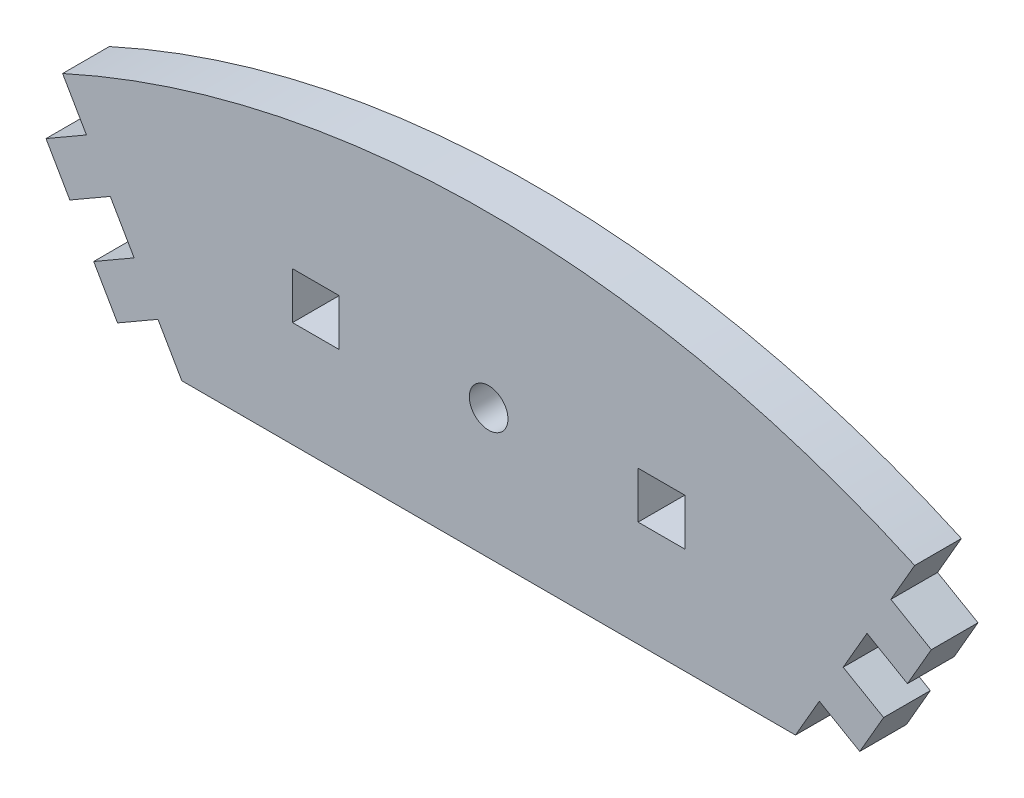
ISO-10303-21;
HEADER;
FILE_DESCRIPTION(('STEP AP214'),'2;1');
FILE_NAME('part.step','',(''),(''),'','','');
FILE_SCHEMA(('AUTOMOTIVE_DESIGN { 1 0 10303 214 1 1 1 1 }'));
ENDSEC;
DATA;
#1=APPLICATION_CONTEXT('core data for automotive mechanical design processes');
#2=APPLICATION_PROTOCOL_DEFINITION('international standard','automotive_design',2000,#1);
#3=PRODUCT_CONTEXT('',#1,'mechanical');
#4=PRODUCT('Part','Part','',(#3));
#5=PRODUCT_RELATED_PRODUCT_CATEGORY('part','',(#4));
#6=PRODUCT_DEFINITION_FORMATION('','',#4);
#7=PRODUCT_DEFINITION_CONTEXT('part definition',#1,'design');
#8=PRODUCT_DEFINITION('design','',#6,#7);
#9=PRODUCT_DEFINITION_SHAPE('','',#8);
#10=(LENGTH_UNIT() NAMED_UNIT(*) SI_UNIT(.MILLI.,.METRE.));
#11=(NAMED_UNIT(*) PLANE_ANGLE_UNIT() SI_UNIT($,.RADIAN.));
#12=(NAMED_UNIT(*) SI_UNIT($,.STERADIAN.) SOLID_ANGLE_UNIT());
#13=UNCERTAINTY_MEASURE_WITH_UNIT(LENGTH_MEASURE(1.E-05),#10,'distance_accuracy_value','');
#14=(GEOMETRIC_REPRESENTATION_CONTEXT(3) GLOBAL_UNCERTAINTY_ASSIGNED_CONTEXT((#13)) GLOBAL_UNIT_ASSIGNED_CONTEXT((#10,
#11,#12)) REPRESENTATION_CONTEXT('',''));
#15=CARTESIAN_POINT('',(0.,0.,0.));
#16=DIRECTION('',(0.,0.,1.));
#17=DIRECTION('',(1.,0.,0.));
#18=AXIS2_PLACEMENT_3D('',#15,#16,#17);
#19=CARTESIAN_POINT('',(-35.403,82.4086096476236,5.));
#20=DIRECTION('',(-0.500000000000001,0.866025403784438,0.));
#21=DIRECTION('',(-0.866025403784438,-0.500000000000001,0.));
#22=AXIS2_PLACEMENT_3D('',#19,#20,#21);
#23=PLANE('',#22);
#24=DIRECTION('',(0.866025403784438,0.500000000000001,0.));
#25=VECTOR('',#24,1.);
#26=CARTESIAN_POINT('',(-35.403,82.4086096476236,0.));
#27=LINE('',#26,#25);
#28=CARTESIAN_POINT('',(-39.7331270189221,79.9086096476237,0.));
#29=VERTEX_POINT('',#28);
#30=CARTESIAN_POINT('',(-35.403,82.4086096476236,0.));
#31=VERTEX_POINT('',#30);
#32=EDGE_CURVE('E283',#29,#31,#27,.T.);
#33=ORIENTED_EDGE('',*,*,#32,.T.);
#34=DIRECTION('',(0.,0.,-1.));
#35=VECTOR('',#34,1.);
#36=CARTESIAN_POINT('',(-35.403,82.4086096476236,5.));
#37=LINE('',#36,#35);
#38=CARTESIAN_POINT('',(-35.403,82.4086096476236,5.));
#39=VERTEX_POINT('',#38);
#40=EDGE_CURVE('E11',#39,#31,#37,.T.);
#41=ORIENTED_EDGE('',*,*,#40,.F.);
#42=DIRECTION('',(0.866025403784438,0.500000000000001,0.));
#43=VECTOR('',#42,1.);
#44=CARTESIAN_POINT('',(-35.403,82.4086096476236,5.));
#45=LINE('',#44,#43);
#46=CARTESIAN_POINT('',(-39.7331270189221,79.9086096476237,5.));
#47=VERTEX_POINT('',#46);
#48=EDGE_CURVE('E290',#47,#39,#45,.T.);
#49=ORIENTED_EDGE('',*,*,#48,.F.);
#50=DIRECTION('',(0.,0.,-1.));
#51=VECTOR('',#50,1.);
#52=CARTESIAN_POINT('',(-39.7331270189221,79.9086096476237,5.));
#53=LINE('',#52,#51);
#54=EDGE_CURVE('E332',#47,#29,#53,.T.);
#55=ORIENTED_EDGE('',*,*,#54,.T.);
#56=EDGE_LOOP('',(#33,#41,#49,#55));
#57=FACE_BOUND('',#56,.T.);
#58=ADVANCED_FACE('F33',(#57),#23,.F.);
#59=CARTESIAN_POINT('',(-32.85,77.9866839359003,5.));
#60=DIRECTION('',(0.866025403784441,0.499999999999996,0.));
#61=DIRECTION('',(-0.499999999999996,0.866025403784441,0.));
#62=AXIS2_PLACEMENT_3D('',#59,#60,#61);
#63=PLANE('',#62);
#64=DIRECTION('',(0.499999999999996,-0.866025403784441,0.));
#65=VECTOR('',#64,1.);
#66=CARTESIAN_POINT('',(-32.85,77.9866839359003,0.));
#67=LINE('',#66,#65);
#68=CARTESIAN_POINT('',(-32.85,77.9866839359003,0.));
#69=VERTEX_POINT('',#68);
#70=EDGE_CURVE('E335',#31,#69,#67,.T.);
#71=ORIENTED_EDGE('',*,*,#70,.T.);
#72=DIRECTION('',(0.,0.,-1.));
#73=VECTOR('',#72,1.);
#74=CARTESIAN_POINT('',(-32.85,77.9866839359003,5.));
#75=LINE('',#74,#73);
#76=CARTESIAN_POINT('',(-32.85,77.9866839359003,5.));
#77=VERTEX_POINT('',#76);
#78=EDGE_CURVE('E40',#77,#69,#75,.T.);
#79=ORIENTED_EDGE('',*,*,#78,.F.);
#80=DIRECTION('',(0.499999999999996,-0.866025403784441,0.));
#81=VECTOR('',#80,1.);
#82=CARTESIAN_POINT('',(-32.85,77.9866839359003,5.));
#83=LINE('',#82,#81);
#84=EDGE_CURVE('E293',#39,#77,#83,.T.);
#85=ORIENTED_EDGE('',*,*,#84,.F.);
#86=ORIENTED_EDGE('',*,*,#40,.T.);
#87=EDGE_LOOP('',(#71,#79,#85,#86));
#88=FACE_BOUND('',#87,.T.);
#89=ADVANCED_FACE('F451',(#88),#63,.F.);
#90=CARTESIAN_POINT('',(-32.85,77.9866839359003,5.));
#91=DIRECTION('',(0.,1.,0.));
#92=DIRECTION('',(-1.,0.,0.));
#93=AXIS2_PLACEMENT_3D('',#90,#91,#92);
#94=PLANE('',#93);
#95=DIRECTION('',(1.,0.,0.));
#96=VECTOR('',#95,1.);
#97=CARTESIAN_POINT('',(-32.85,77.9866839359003,0.));
#98=LINE('',#97,#96);
#99=CARTESIAN_POINT('',(32.85,77.9866839359003,0.));
#100=VERTEX_POINT('',#99);
#101=EDGE_CURVE('E337',#69,#100,#98,.T.);
#102=ORIENTED_EDGE('',*,*,#101,.T.);
#103=DIRECTION('',(0.,0.,-1.));
#104=VECTOR('',#103,1.);
#105=CARTESIAN_POINT('',(32.85,77.9866839359003,5.));
#106=LINE('',#105,#104);
#107=CARTESIAN_POINT('',(32.85,77.9866839359003,5.));
#108=VERTEX_POINT('',#107);
#109=EDGE_CURVE('E422',#108,#100,#106,.T.);
#110=ORIENTED_EDGE('',*,*,#109,.F.);
#111=DIRECTION('',(1.,0.,0.));
#112=VECTOR('',#111,1.);
#113=CARTESIAN_POINT('',(-32.85,77.9866839359003,5.));
#114=LINE('',#113,#112);
#115=EDGE_CURVE('E296',#77,#108,#114,.T.);
#116=ORIENTED_EDGE('',*,*,#115,.F.);
#117=ORIENTED_EDGE('',*,*,#78,.T.);
#118=EDGE_LOOP('',(#102,#110,#116,#117));
#119=FACE_BOUND('',#118,.T.);
#120=ADVANCED_FACE('F429',(#119),#94,.F.);
#121=CARTESIAN_POINT('',(32.85,77.9866839359003,5.));
#122=DIRECTION('',(-0.86602540378444,0.499999999999997,0.));
#123=DIRECTION('',(-0.499999999999997,-0.86602540378444,0.));
#124=AXIS2_PLACEMENT_3D('',#121,#122,#123);
#125=PLANE('',#124);
#126=DIRECTION('',(0.499999999999997,0.86602540378444,0.));
#127=VECTOR('',#126,1.);
#128=CARTESIAN_POINT('',(32.85,77.9866839359003,0.));
#129=LINE('',#128,#127);
#130=CARTESIAN_POINT('',(35.403,82.4086096476236,0.));
#131=VERTEX_POINT('',#130);
#132=EDGE_CURVE('E339',#100,#131,#129,.T.);
#133=ORIENTED_EDGE('',*,*,#132,.T.);
#134=DIRECTION('',(0.,0.,-1.));
#135=VECTOR('',#134,1.);
#136=CARTESIAN_POINT('',(35.403,82.4086096476236,5.));
#137=LINE('',#136,#135);
#138=CARTESIAN_POINT('',(35.403,82.4086096476236,5.));
#139=VERTEX_POINT('',#138);
#140=EDGE_CURVE('E419',#139,#131,#137,.T.);
#141=ORIENTED_EDGE('',*,*,#140,.F.);
#142=DIRECTION('',(0.499999999999997,0.86602540378444,0.));
#143=VECTOR('',#142,1.);
#144=CARTESIAN_POINT('',(32.85,77.9866839359003,5.));
#145=LINE('',#144,#143);
#146=EDGE_CURVE('E298',#108,#139,#145,.T.);
#147=ORIENTED_EDGE('',*,*,#146,.F.);
#148=ORIENTED_EDGE('',*,*,#109,.T.);
#149=EDGE_LOOP('',(#133,#141,#147,#148));
#150=FACE_BOUND('',#149,.T.);
#151=ADVANCED_FACE('F439',(#150),#125,.F.);
#152=CARTESIAN_POINT('',(35.403,82.4086096476236,5.));
#153=DIRECTION('',(0.500000000000001,0.866025403784438,0.));
#154=DIRECTION('',(-0.866025403784438,0.500000000000001,0.));
#155=AXIS2_PLACEMENT_3D('',#152,#153,#154);
#156=PLANE('',#155);
#157=DIRECTION('',(0.866025403784438,-0.500000000000001,0.));
#158=VECTOR('',#157,1.);
#159=CARTESIAN_POINT('',(35.403,82.4086096476236,0.));
#160=LINE('',#159,#158);
#161=CARTESIAN_POINT('',(39.7331270189221,79.9086096476237,0.));
#162=VERTEX_POINT('',#161);
#163=EDGE_CURVE('E341',#131,#162,#160,.T.);
#164=ORIENTED_EDGE('',*,*,#163,.T.);
#165=DIRECTION('',(0.,0.,-1.));
#166=VECTOR('',#165,1.);
#167=CARTESIAN_POINT('',(39.7331270189221,79.9086096476237,5.));
#168=LINE('',#167,#166);
#169=CARTESIAN_POINT('',(39.7331270189221,79.9086096476237,5.));
#170=VERTEX_POINT('',#169);
#171=EDGE_CURVE('E416',#170,#162,#168,.T.);
#172=ORIENTED_EDGE('',*,*,#171,.F.);
#173=DIRECTION('',(0.866025403784438,-0.500000000000001,0.));
#174=VECTOR('',#173,1.);
#175=CARTESIAN_POINT('',(35.403,82.4086096476236,5.));
#176=LINE('',#175,#174);
#177=EDGE_CURVE('E300',#139,#170,#176,.T.);
#178=ORIENTED_EDGE('',*,*,#177,.F.);
#179=ORIENTED_EDGE('',*,*,#140,.T.);
#180=EDGE_LOOP('',(#164,#172,#178,#179));
#181=FACE_BOUND('',#180,.T.);
#182=ADVANCED_FACE('F443',(#181),#156,.F.);
#183=CARTESIAN_POINT('',(39.7331270189221,79.9086096476237,5.));
#184=DIRECTION('',(-0.866025403784439,0.499999999999999,0.));
#185=DIRECTION('',(-0.499999999999999,-0.866025403784439,0.));
#186=AXIS2_PLACEMENT_3D('',#183,#184,#185);
#187=PLANE('',#186);
#188=DIRECTION('',(0.499999999999999,0.866025403784439,0.));
#189=VECTOR('',#188,1.);
#190=CARTESIAN_POINT('',(39.7331270189221,79.9086096476237,0.));
#191=LINE('',#190,#189);
#192=CARTESIAN_POINT('',(42.2861270189221,84.330535359347,0.));
#193=VERTEX_POINT('',#192);
#194=EDGE_CURVE('E343',#162,#193,#191,.T.);
#195=ORIENTED_EDGE('',*,*,#194,.T.);
#196=DIRECTION('',(0.,0.,-1.));
#197=VECTOR('',#196,1.);
#198=CARTESIAN_POINT('',(42.2861270189221,84.330535359347,5.));
#199=LINE('',#198,#197);
#200=CARTESIAN_POINT('',(42.2861270189221,84.330535359347,5.));
#201=VERTEX_POINT('',#200);
#202=EDGE_CURVE('E413',#201,#193,#199,.T.);
#203=ORIENTED_EDGE('',*,*,#202,.F.);
#204=DIRECTION('',(0.499999999999999,0.866025403784439,0.));
#205=VECTOR('',#204,1.);
#206=CARTESIAN_POINT('',(39.7331270189221,79.9086096476237,5.));
#207=LINE('',#206,#205);
#208=EDGE_CURVE('E302',#170,#201,#207,.T.);
#209=ORIENTED_EDGE('',*,*,#208,.F.);
#210=ORIENTED_EDGE('',*,*,#171,.T.);
#211=EDGE_LOOP('',(#195,#203,#209,#210));
#212=FACE_BOUND('',#211,.T.);
#213=ADVANCED_FACE('F524',(#212),#187,.F.);
#214=CARTESIAN_POINT('',(42.2861270189221,84.330535359347,5.));
#215=DIRECTION('',(-0.499999999999999,-0.866025403784439,0.));
#216=DIRECTION('',(0.866025403784439,-0.499999999999999,0.));
#217=AXIS2_PLACEMENT_3D('',#214,#215,#216);
#218=PLANE('',#217);
#219=DIRECTION('',(-0.866025403784439,0.499999999999999,0.));
#220=VECTOR('',#219,1.);
#221=CARTESIAN_POINT('',(42.2861270189221,84.330535359347,0.));
#222=LINE('',#221,#220);
#223=CARTESIAN_POINT('',(37.956,86.830535359347,0.));
#224=VERTEX_POINT('',#223);
#225=EDGE_CURVE('E345',#193,#224,#222,.T.);
#226=ORIENTED_EDGE('',*,*,#225,.T.);
#227=DIRECTION('',(0.,0.,-1.));
#228=VECTOR('',#227,1.);
#229=CARTESIAN_POINT('',(37.956,86.830535359347,5.));
#230=LINE('',#229,#228);
#231=CARTESIAN_POINT('',(37.956,86.830535359347,5.));
#232=VERTEX_POINT('',#231);
#233=EDGE_CURVE('E410',#232,#224,#230,.T.);
#234=ORIENTED_EDGE('',*,*,#233,.F.);
#235=DIRECTION('',(-0.866025403784439,0.499999999999999,0.));
#236=VECTOR('',#235,1.);
#237=CARTESIAN_POINT('',(42.2861270189221,84.330535359347,5.));
#238=LINE('',#237,#236);
#239=EDGE_CURVE('E304',#201,#232,#238,.T.);
#240=ORIENTED_EDGE('',*,*,#239,.F.);
#241=ORIENTED_EDGE('',*,*,#202,.T.);
#242=EDGE_LOOP('',(#226,#234,#240,#241));
#243=FACE_BOUND('',#242,.T.);
#244=ADVANCED_FACE('F522',(#243),#218,.F.);
#245=CARTESIAN_POINT('',(37.956,86.830535359347,5.));
#246=DIRECTION('',(-0.86602540378444,0.499999999999998,0.));
#247=DIRECTION('',(-0.499999999999998,-0.86602540378444,0.));
#248=AXIS2_PLACEMENT_3D('',#245,#246,#247);
#249=PLANE('',#248);
#250=DIRECTION('',(0.499999999999998,0.86602540378444,0.));
#251=VECTOR('',#250,1.);
#252=CARTESIAN_POINT('',(37.956,86.830535359347,0.));
#253=LINE('',#252,#251);
#254=CARTESIAN_POINT('',(40.509,91.2524610710703,0.));
#255=VERTEX_POINT('',#254);
#256=EDGE_CURVE('E347',#224,#255,#253,.T.);
#257=ORIENTED_EDGE('',*,*,#256,.T.);
#258=DIRECTION('',(0.,0.,-1.));
#259=VECTOR('',#258,1.);
#260=CARTESIAN_POINT('',(40.509,91.2524610710703,5.));
#261=LINE('',#260,#259);
#262=CARTESIAN_POINT('',(40.509,91.2524610710703,5.));
#263=VERTEX_POINT('',#262);
#264=EDGE_CURVE('E407',#263,#255,#261,.T.);
#265=ORIENTED_EDGE('',*,*,#264,.F.);
#266=DIRECTION('',(0.499999999999998,0.86602540378444,0.));
#267=VECTOR('',#266,1.);
#268=CARTESIAN_POINT('',(37.956,86.830535359347,5.));
#269=LINE('',#268,#267);
#270=EDGE_CURVE('E306',#232,#263,#269,.T.);
#271=ORIENTED_EDGE('',*,*,#270,.F.);
#272=ORIENTED_EDGE('',*,*,#233,.T.);
#273=EDGE_LOOP('',(#257,#265,#271,#272));
#274=FACE_BOUND('',#273,.T.);
#275=ADVANCED_FACE('F517',(#274),#249,.F.);
#276=CARTESIAN_POINT('',(40.509,91.2524610710703,5.));
#277=DIRECTION('',(0.499999999999999,0.866025403784439,0.));
#278=DIRECTION('',(-0.866025403784439,0.499999999999999,0.));
#279=AXIS2_PLACEMENT_3D('',#276,#277,#278);
#280=PLANE('',#279);
#281=DIRECTION('',(0.866025403784439,-0.499999999999999,0.));
#282=VECTOR('',#281,1.);
#283=CARTESIAN_POINT('',(40.509,91.2524610710703,0.));
#284=LINE('',#283,#282);
#285=CARTESIAN_POINT('',(44.8391270189221,88.7524610710704,0.));
#286=VERTEX_POINT('',#285);
#287=EDGE_CURVE('E349',#255,#286,#284,.T.);
#288=ORIENTED_EDGE('',*,*,#287,.T.);
#289=DIRECTION('',(0.,0.,-1.));
#290=VECTOR('',#289,1.);
#291=CARTESIAN_POINT('',(44.8391270189221,88.7524610710704,5.));
#292=LINE('',#291,#290);
#293=CARTESIAN_POINT('',(44.8391270189221,88.7524610710704,5.));
#294=VERTEX_POINT('',#293);
#295=EDGE_CURVE('E404',#294,#286,#292,.T.);
#296=ORIENTED_EDGE('',*,*,#295,.F.);
#297=DIRECTION('',(0.866025403784439,-0.499999999999999,0.));
#298=VECTOR('',#297,1.);
#299=CARTESIAN_POINT('',(40.509,91.2524610710703,5.));
#300=LINE('',#299,#298);
#301=EDGE_CURVE('E308',#263,#294,#300,.T.);
#302=ORIENTED_EDGE('',*,*,#301,.F.);
#303=ORIENTED_EDGE('',*,*,#264,.T.);
#304=EDGE_LOOP('',(#288,#296,#302,#303));
#305=FACE_BOUND('',#304,.T.);
#306=ADVANCED_FACE('F512',(#305),#280,.F.);
#307=CARTESIAN_POINT('',(44.8391270189221,88.7524610710704,5.));
#308=DIRECTION('',(-0.866025403784441,0.499999999999995,0.));
#309=DIRECTION('',(-0.499999999999995,-0.866025403784441,0.));
#310=AXIS2_PLACEMENT_3D('',#307,#308,#309);
#311=PLANE('',#310);
#312=DIRECTION('',(0.499999999999995,0.866025403784441,0.));
#313=VECTOR('',#312,1.);
#314=CARTESIAN_POINT('',(44.8391270189221,88.7524610710704,0.));
#315=LINE('',#314,#313);
#316=CARTESIAN_POINT('',(47.3921270189221,93.1743867827937,0.));
#317=VERTEX_POINT('',#316);
#318=EDGE_CURVE('E351',#286,#317,#315,.T.);
#319=ORIENTED_EDGE('',*,*,#318,.T.);
#320=DIRECTION('',(0.,0.,-1.));
#321=VECTOR('',#320,1.);
#322=CARTESIAN_POINT('',(47.3921270189221,93.1743867827937,5.));
#323=LINE('',#322,#321);
#324=CARTESIAN_POINT('',(47.3921270189221,93.1743867827937,5.));
#325=VERTEX_POINT('',#324);
#326=EDGE_CURVE('E401',#325,#317,#323,.T.);
#327=ORIENTED_EDGE('',*,*,#326,.F.);
#328=DIRECTION('',(0.499999999999995,0.866025403784441,0.));
#329=VECTOR('',#328,1.);
#330=CARTESIAN_POINT('',(44.8391270189221,88.7524610710704,5.));
#331=LINE('',#330,#329);
#332=EDGE_CURVE('E310',#294,#325,#331,.T.);
#333=ORIENTED_EDGE('',*,*,#332,.F.);
#334=ORIENTED_EDGE('',*,*,#295,.T.);
#335=EDGE_LOOP('',(#319,#327,#333,#334));
#336=FACE_BOUND('',#335,.T.);
#337=ADVANCED_FACE('F508',(#336),#311,.F.);
#338=CARTESIAN_POINT('',(47.3921270189221,93.1743867827937,5.));
#339=DIRECTION('',(-0.500000000000003,-0.866025403784437,0.));
#340=DIRECTION('',(0.866025403784437,-0.500000000000003,0.));
#341=AXIS2_PLACEMENT_3D('',#338,#339,#340);
#342=PLANE('',#341);
#343=DIRECTION('',(-0.866025403784437,0.500000000000003,0.));
#344=VECTOR('',#343,1.);
#345=CARTESIAN_POINT('',(47.3921270189221,93.1743867827937,0.));
#346=LINE('',#345,#344);
#347=CARTESIAN_POINT('',(43.062,95.6743867827937,0.));
#348=VERTEX_POINT('',#347);
#349=EDGE_CURVE('E353',#317,#348,#346,.T.);
#350=ORIENTED_EDGE('',*,*,#349,.T.);
#351=DIRECTION('',(0.,0.,-1.));
#352=VECTOR('',#351,1.);
#353=CARTESIAN_POINT('',(43.062,95.6743867827937,5.));
#354=LINE('',#353,#352);
#355=CARTESIAN_POINT('',(43.062,95.6743867827937,5.));
#356=VERTEX_POINT('',#355);
#357=EDGE_CURVE('E398',#356,#348,#354,.T.);
#358=ORIENTED_EDGE('',*,*,#357,.F.);
#359=DIRECTION('',(-0.866025403784437,0.500000000000003,0.));
#360=VECTOR('',#359,1.);
#361=CARTESIAN_POINT('',(47.3921270189221,93.1743867827937,5.));
#362=LINE('',#361,#360);
#363=EDGE_CURVE('E312',#325,#356,#362,.T.);
#364=ORIENTED_EDGE('',*,*,#363,.F.);
#365=ORIENTED_EDGE('',*,*,#326,.T.);
#366=EDGE_LOOP('',(#350,#358,#364,#365));
#367=FACE_BOUND('',#366,.T.);
#368=ADVANCED_FACE('F503',(#367),#342,.F.);
#369=CARTESIAN_POINT('',(43.062,95.6743867827937,5.));
#370=DIRECTION('',(-0.866025403784439,0.499999999999999,0.));
#371=DIRECTION('',(-0.499999999999999,-0.866025403784439,0.));
#372=AXIS2_PLACEMENT_3D('',#369,#370,#371);
#373=PLANE('',#372);
#374=DIRECTION('',(0.499999999999999,0.866025403784439,0.));
#375=VECTOR('',#374,1.);
#376=CARTESIAN_POINT('',(43.062,95.6743867827937,0.));
#377=LINE('',#376,#375);
#378=CARTESIAN_POINT('',(45.615,100.096312494517,0.));
#379=VERTEX_POINT('',#378);
#380=EDGE_CURVE('E355',#348,#379,#377,.T.);
#381=ORIENTED_EDGE('',*,*,#380,.T.);
#382=DIRECTION('',(0.,0.,-1.));
#383=VECTOR('',#382,1.);
#384=CARTESIAN_POINT('',(45.615,100.096312494517,5.));
#385=LINE('',#384,#383);
#386=CARTESIAN_POINT('',(45.615,100.096312494517,5.));
#387=VERTEX_POINT('',#386);
#388=EDGE_CURVE('E395',#387,#379,#385,.T.);
#389=ORIENTED_EDGE('',*,*,#388,.F.);
#390=DIRECTION('',(0.499999999999999,0.866025403784439,0.));
#391=VECTOR('',#390,1.);
#392=CARTESIAN_POINT('',(43.062,95.6743867827937,5.));
#393=LINE('',#392,#391);
#394=EDGE_CURVE('E314',#356,#387,#393,.T.);
#395=ORIENTED_EDGE('',*,*,#394,.F.);
#396=ORIENTED_EDGE('',*,*,#357,.T.);
#397=EDGE_LOOP('',(#381,#389,#395,#396));
#398=FACE_BOUND('',#397,.T.);
#399=ADVANCED_FACE('F497',(#398),#373,.F.);
#400=CARTESIAN_POINT('',(0.,0.,5.));
#401=DIRECTION('',(0.,0.,-1.));
#402=DIRECTION('',(-1.,0.,0.));
#403=AXIS2_PLACEMENT_3D('',#400,#401,#402);
#404=CYLINDRICAL_SURFACE('',#403,110.);
#405=CARTESIAN_POINT('',(0.,0.,0.));
#406=DIRECTION('',(0.,0.,1.));
#407=DIRECTION('',(-1.,0.,0.));
#408=AXIS2_PLACEMENT_3D('',#405,#406,#407);
#409=CIRCLE('',#408,110.);
#410=CARTESIAN_POINT('',(-45.615,100.096312494517,0.));
#411=VERTEX_POINT('',#410);
#412=EDGE_CURVE('E357',#379,#411,#409,.T.);
#413=ORIENTED_EDGE('',*,*,#412,.T.);
#414=DIRECTION('',(0.,0.,-1.));
#415=VECTOR('',#414,1.);
#416=CARTESIAN_POINT('',(-45.615,100.096312494517,5.));
#417=LINE('',#416,#415);
#418=CARTESIAN_POINT('',(-45.615,100.096312494517,5.));
#419=VERTEX_POINT('',#418);
#420=EDGE_CURVE('E392',#419,#411,#417,.T.);
#421=ORIENTED_EDGE('',*,*,#420,.F.);
#422=CARTESIAN_POINT('',(0.,0.,5.));
#423=DIRECTION('',(0.,0.,1.));
#424=DIRECTION('',(-1.,0.,0.));
#425=AXIS2_PLACEMENT_3D('',#422,#423,#424);
#426=CIRCLE('',#425,110.);
#427=EDGE_CURVE('E316',#387,#419,#426,.T.);
#428=ORIENTED_EDGE('',*,*,#427,.F.);
#429=ORIENTED_EDGE('',*,*,#388,.T.);
#430=EDGE_LOOP('',(#413,#421,#428,#429));
#431=FACE_BOUND('',#430,.T.);
#432=ADVANCED_FACE('F493',(#431),#404,.T.);
#433=CARTESIAN_POINT('',(-43.062,95.6743867827937,5.));
#434=DIRECTION('',(0.866025403784439,0.499999999999999,0.));
#435=DIRECTION('',(-0.499999999999999,0.866025403784439,0.));
#436=AXIS2_PLACEMENT_3D('',#433,#434,#435);
#437=PLANE('',#436);
#438=DIRECTION('',(0.499999999999999,-0.866025403784439,0.));
#439=VECTOR('',#438,1.);
#440=CARTESIAN_POINT('',(-43.062,95.6743867827937,0.));
#441=LINE('',#440,#439);
#442=CARTESIAN_POINT('',(-43.062,95.6743867827937,0.));
#443=VERTEX_POINT('',#442);
#444=EDGE_CURVE('E359',#411,#443,#441,.T.);
#445=ORIENTED_EDGE('',*,*,#444,.T.);
#446=DIRECTION('',(0.,0.,-1.));
#447=VECTOR('',#446,1.);
#448=CARTESIAN_POINT('',(-43.062,95.6743867827937,5.));
#449=LINE('',#448,#447);
#450=CARTESIAN_POINT('',(-43.062,95.6743867827937,5.));
#451=VERTEX_POINT('',#450);
#452=EDGE_CURVE('E389',#451,#443,#449,.T.);
#453=ORIENTED_EDGE('',*,*,#452,.F.);
#454=DIRECTION('',(0.499999999999999,-0.866025403784439,0.));
#455=VECTOR('',#454,1.);
#456=CARTESIAN_POINT('',(-43.062,95.6743867827937,5.));
#457=LINE('',#456,#455);
#458=EDGE_CURVE('E318',#419,#451,#457,.T.);
#459=ORIENTED_EDGE('',*,*,#458,.F.);
#460=ORIENTED_EDGE('',*,*,#420,.T.);
#461=EDGE_LOOP('',(#445,#453,#459,#460));
#462=FACE_BOUND('',#461,.T.);
#463=ADVANCED_FACE('F488',(#462),#437,.F.);
#464=CARTESIAN_POINT('',(-47.3921270189221,93.1743867827937,5.));
#465=DIRECTION('',(0.500000000000003,-0.866025403784437,0.));
#466=DIRECTION('',(0.866025403784437,0.500000000000003,0.));
#467=AXIS2_PLACEMENT_3D('',#464,#465,#466);
#468=PLANE('',#467);
#469=DIRECTION('',(-0.866025403784437,-0.500000000000003,0.));
#470=VECTOR('',#469,1.);
#471=CARTESIAN_POINT('',(-47.3921270189221,93.1743867827937,0.));
#472=LINE('',#471,#470);
#473=CARTESIAN_POINT('',(-47.3921270189221,93.1743867827937,0.));
#474=VERTEX_POINT('',#473);
#475=EDGE_CURVE('E361',#443,#474,#472,.T.);
#476=ORIENTED_EDGE('',*,*,#475,.T.);
#477=DIRECTION('',(0.,0.,-1.));
#478=VECTOR('',#477,1.);
#479=CARTESIAN_POINT('',(-47.3921270189221,93.1743867827937,5.));
#480=LINE('',#479,#478);
#481=CARTESIAN_POINT('',(-47.3921270189221,93.1743867827937,5.));
#482=VERTEX_POINT('',#481);
#483=EDGE_CURVE('E386',#482,#474,#480,.T.);
#484=ORIENTED_EDGE('',*,*,#483,.F.);
#485=DIRECTION('',(-0.866025403784437,-0.500000000000003,0.));
#486=VECTOR('',#485,1.);
#487=CARTESIAN_POINT('',(-47.3921270189221,93.1743867827937,5.));
#488=LINE('',#487,#486);
#489=EDGE_CURVE('E320',#451,#482,#488,.T.);
#490=ORIENTED_EDGE('',*,*,#489,.F.);
#491=ORIENTED_EDGE('',*,*,#452,.T.);
#492=EDGE_LOOP('',(#476,#484,#490,#491));
#493=FACE_BOUND('',#492,.T.);
#494=ADVANCED_FACE('F482',(#493),#468,.F.);
#495=CARTESIAN_POINT('',(-44.8391270189221,88.7524610710704,5.));
#496=DIRECTION('',(0.866025403784441,0.499999999999995,0.));
#497=DIRECTION('',(-0.499999999999995,0.866025403784441,0.));
#498=AXIS2_PLACEMENT_3D('',#495,#496,#497);
#499=PLANE('',#498);
#500=DIRECTION('',(0.499999999999995,-0.866025403784441,0.));
#501=VECTOR('',#500,1.);
#502=CARTESIAN_POINT('',(-44.8391270189221,88.7524610710704,0.));
#503=LINE('',#502,#501);
#504=CARTESIAN_POINT('',(-44.8391270189221,88.7524610710704,0.));
#505=VERTEX_POINT('',#504);
#506=EDGE_CURVE('E363',#474,#505,#503,.T.);
#507=ORIENTED_EDGE('',*,*,#506,.T.);
#508=DIRECTION('',(0.,0.,-1.));
#509=VECTOR('',#508,1.);
#510=CARTESIAN_POINT('',(-44.8391270189221,88.7524610710704,5.));
#511=LINE('',#510,#509);
#512=CARTESIAN_POINT('',(-44.8391270189221,88.7524610710704,5.));
#513=VERTEX_POINT('',#512);
#514=EDGE_CURVE('E383',#513,#505,#511,.T.);
#515=ORIENTED_EDGE('',*,*,#514,.F.);
#516=DIRECTION('',(0.499999999999995,-0.866025403784441,0.));
#517=VECTOR('',#516,1.);
#518=CARTESIAN_POINT('',(-44.8391270189221,88.7524610710704,5.));
#519=LINE('',#518,#517);
#520=EDGE_CURVE('E322',#482,#513,#519,.T.);
#521=ORIENTED_EDGE('',*,*,#520,.F.);
#522=ORIENTED_EDGE('',*,*,#483,.T.);
#523=EDGE_LOOP('',(#507,#515,#521,#522));
#524=FACE_BOUND('',#523,.T.);
#525=ADVANCED_FACE('F478',(#524),#499,.F.);
#526=CARTESIAN_POINT('',(-40.509,91.2524610710703,5.));
#527=DIRECTION('',(-0.499999999999999,0.866025403784439,0.));
#528=DIRECTION('',(-0.866025403784439,-0.499999999999999,0.));
#529=AXIS2_PLACEMENT_3D('',#526,#527,#528);
#530=PLANE('',#529);
#531=DIRECTION('',(0.866025403784439,0.499999999999999,0.));
#532=VECTOR('',#531,1.);
#533=CARTESIAN_POINT('',(-40.509,91.2524610710703,0.));
#534=LINE('',#533,#532);
#535=CARTESIAN_POINT('',(-40.509,91.2524610710703,0.));
#536=VERTEX_POINT('',#535);
#537=EDGE_CURVE('E365',#505,#536,#534,.T.);
#538=ORIENTED_EDGE('',*,*,#537,.T.);
#539=DIRECTION('',(0.,0.,-1.));
#540=VECTOR('',#539,1.);
#541=CARTESIAN_POINT('',(-40.509,91.2524610710703,5.));
#542=LINE('',#541,#540);
#543=CARTESIAN_POINT('',(-40.509,91.2524610710703,5.));
#544=VERTEX_POINT('',#543);
#545=EDGE_CURVE('E380',#544,#536,#542,.T.);
#546=ORIENTED_EDGE('',*,*,#545,.F.);
#547=DIRECTION('',(0.866025403784439,0.499999999999999,0.));
#548=VECTOR('',#547,1.);
#549=CARTESIAN_POINT('',(-40.509,91.2524610710703,5.));
#550=LINE('',#549,#548);
#551=EDGE_CURVE('E324',#513,#544,#550,.T.);
#552=ORIENTED_EDGE('',*,*,#551,.F.);
#553=ORIENTED_EDGE('',*,*,#514,.T.);
#554=EDGE_LOOP('',(#538,#546,#552,#553));
#555=FACE_BOUND('',#554,.T.);
#556=ADVANCED_FACE('F473',(#555),#530,.F.);
#557=CARTESIAN_POINT('',(-37.956,86.830535359347,5.));
#558=DIRECTION('',(0.86602540378444,0.499999999999998,0.));
#559=DIRECTION('',(-0.499999999999998,0.86602540378444,0.));
#560=AXIS2_PLACEMENT_3D('',#557,#558,#559);
#561=PLANE('',#560);
#562=DIRECTION('',(0.499999999999998,-0.86602540378444,0.));
#563=VECTOR('',#562,1.);
#564=CARTESIAN_POINT('',(-37.956,86.830535359347,0.));
#565=LINE('',#564,#563);
#566=CARTESIAN_POINT('',(-37.956,86.830535359347,0.));
#567=VERTEX_POINT('',#566);
#568=EDGE_CURVE('E367',#536,#567,#565,.T.);
#569=ORIENTED_EDGE('',*,*,#568,.T.);
#570=DIRECTION('',(0.,0.,-1.));
#571=VECTOR('',#570,1.);
#572=CARTESIAN_POINT('',(-37.956,86.830535359347,5.));
#573=LINE('',#572,#571);
#574=CARTESIAN_POINT('',(-37.956,86.830535359347,5.));
#575=VERTEX_POINT('',#574);
#576=EDGE_CURVE('E377',#575,#567,#573,.T.);
#577=ORIENTED_EDGE('',*,*,#576,.F.);
#578=DIRECTION('',(0.499999999999998,-0.86602540378444,0.));
#579=VECTOR('',#578,1.);
#580=CARTESIAN_POINT('',(-37.956,86.830535359347,5.));
#581=LINE('',#580,#579);
#582=EDGE_CURVE('E326',#544,#575,#581,.T.);
#583=ORIENTED_EDGE('',*,*,#582,.F.);
#584=ORIENTED_EDGE('',*,*,#545,.T.);
#585=EDGE_LOOP('',(#569,#577,#583,#584));
#586=FACE_BOUND('',#585,.T.);
#587=ADVANCED_FACE('F467',(#586),#561,.F.);
#588=CARTESIAN_POINT('',(-42.2861270189221,84.330535359347,5.));
#589=DIRECTION('',(0.499999999999999,-0.866025403784439,0.));
#590=DIRECTION('',(0.866025403784439,0.499999999999999,0.));
#591=AXIS2_PLACEMENT_3D('',#588,#589,#590);
#592=PLANE('',#591);
#593=DIRECTION('',(-0.866025403784439,-0.499999999999999,0.));
#594=VECTOR('',#593,1.);
#595=CARTESIAN_POINT('',(-42.2861270189221,84.330535359347,0.));
#596=LINE('',#595,#594);
#597=CARTESIAN_POINT('',(-42.2861270189221,84.330535359347,0.));
#598=VERTEX_POINT('',#597);
#599=EDGE_CURVE('E369',#567,#598,#596,.T.);
#600=ORIENTED_EDGE('',*,*,#599,.T.);
#601=DIRECTION('',(0.,0.,-1.));
#602=VECTOR('',#601,1.);
#603=CARTESIAN_POINT('',(-42.2861270189221,84.330535359347,5.));
#604=LINE('',#603,#602);
#605=CARTESIAN_POINT('',(-42.2861270189221,84.330535359347,5.));
#606=VERTEX_POINT('',#605);
#607=EDGE_CURVE('E374',#606,#598,#604,.T.);
#608=ORIENTED_EDGE('',*,*,#607,.F.);
#609=DIRECTION('',(-0.866025403784439,-0.499999999999999,0.));
#610=VECTOR('',#609,1.);
#611=CARTESIAN_POINT('',(-42.2861270189221,84.330535359347,5.));
#612=LINE('',#611,#610);
#613=EDGE_CURVE('E328',#575,#606,#612,.T.);
#614=ORIENTED_EDGE('',*,*,#613,.F.);
#615=ORIENTED_EDGE('',*,*,#576,.T.);
#616=EDGE_LOOP('',(#600,#608,#614,#615));
#617=FACE_BOUND('',#616,.T.);
#618=ADVANCED_FACE('F463',(#617),#592,.F.);
#619=CARTESIAN_POINT('',(-39.7331270189221,79.9086096476237,5.));
#620=DIRECTION('',(0.866025403784439,0.499999999999999,0.));
#621=DIRECTION('',(-0.499999999999999,0.866025403784439,0.));
#622=AXIS2_PLACEMENT_3D('',#619,#620,#621);
#623=PLANE('',#622);
#624=DIRECTION('',(0.499999999999999,-0.866025403784439,0.));
#625=VECTOR('',#624,1.);
#626=CARTESIAN_POINT('',(-39.7331270189221,79.9086096476237,0.));
#627=LINE('',#626,#625);
#628=EDGE_CURVE('E294',#598,#29,#627,.T.);
#629=ORIENTED_EDGE('',*,*,#628,.T.);
#630=ORIENTED_EDGE('',*,*,#54,.F.);
#631=DIRECTION('',(0.499999999999999,-0.866025403784439,0.));
#632=VECTOR('',#631,1.);
#633=CARTESIAN_POINT('',(-39.7331270189221,79.9086096476237,5.));
#634=LINE('',#633,#632);
#635=EDGE_CURVE('E330',#606,#47,#634,.T.);
#636=ORIENTED_EDGE('',*,*,#635,.F.);
#637=ORIENTED_EDGE('',*,*,#607,.T.);
#638=EDGE_LOOP('',(#629,#630,#636,#637));
#639=FACE_BOUND('',#638,.T.);
#640=ADVANCED_FACE('F458',(#639),#623,.F.);
#641=CARTESIAN_POINT('',(0.,0.,5.));
#642=DIRECTION('',(0.,0.,-1.));
#643=DIRECTION('',(-1.,0.,0.));
#644=AXIS2_PLACEMENT_3D('',#641,#642,#643);
#645=PLANE('',#644);
#646=CARTESIAN_POINT('',(0.,91.8974143871666,5.));
#647=DIRECTION('',(0.,0.,1.));
#648=DIRECTION('',(1.,0.,0.));
#649=AXIS2_PLACEMENT_3D('',#646,#647,#648);
#650=CIRCLE('',#649,2.06749999999999);
#651=CARTESIAN_POINT('',(2.0675,91.8974143871666,5.));
#652=VERTEX_POINT('',#651);
#653=EDGE_CURVE('E241',#652,#652,#650,.T.);
#654=ORIENTED_EDGE('',*,*,#653,.F.);
#655=EDGE_LOOP('',(#654));
#656=FACE_BOUND('',#655,.T.);
#657=DIRECTION('',(1.,0.,0.));
#658=VECTOR('',#657,1.);
#659=CARTESIAN_POINT('',(-16.,89.3078211125544,5.));
#660=LINE('',#659,#658);
#661=CARTESIAN_POINT('',(-21.,89.3078211125544,5.));
#662=VERTEX_POINT('',#661);
#663=CARTESIAN_POINT('',(-16.,89.3078211125544,5.));
#664=VERTEX_POINT('',#663);
#665=EDGE_CURVE('E247',#662,#664,#660,.T.);
#666=ORIENTED_EDGE('',*,*,#665,.F.);
#667=DIRECTION('',(0.,-1.,0.));
#668=VECTOR('',#667,1.);
#669=CARTESIAN_POINT('',(-21.,89.3078211125544,5.));
#670=LINE('',#669,#668);
#671=CARTESIAN_POINT('',(-21.,94.3078211125544,5.));
#672=VERTEX_POINT('',#671);
#673=EDGE_CURVE('E47',#672,#662,#670,.T.);
#674=ORIENTED_EDGE('',*,*,#673,.F.);
#675=DIRECTION('',(-1.,0.,0.));
#676=VECTOR('',#675,1.);
#677=CARTESIAN_POINT('',(-16.,94.3078211125544,5.));
#678=LINE('',#677,#676);
#679=CARTESIAN_POINT('',(-16.,94.3078211125544,5.));
#680=VERTEX_POINT('',#679);
#681=EDGE_CURVE('E235',#680,#672,#678,.T.);
#682=ORIENTED_EDGE('',*,*,#681,.F.);
#683=DIRECTION('',(0.,1.,0.));
#684=VECTOR('',#683,1.);
#685=CARTESIAN_POINT('',(-16.,89.3078211125544,5.));
#686=LINE('',#685,#684);
#687=EDGE_CURVE('E238',#664,#680,#686,.T.);
#688=ORIENTED_EDGE('',*,*,#687,.F.);
#689=EDGE_LOOP('',(#666,#674,#682,#688));
#690=FACE_BOUND('',#689,.T.);
#691=DIRECTION('',(1.,0.,0.));
#692=VECTOR('',#691,1.);
#693=CARTESIAN_POINT('',(16.,89.3078211125544,5.));
#694=LINE('',#693,#692);
#695=CARTESIAN_POINT('',(16.,89.3078211125544,5.));
#696=VERTEX_POINT('',#695);
#697=CARTESIAN_POINT('',(21.,89.3078211125544,5.));
#698=VERTEX_POINT('',#697);
#699=EDGE_CURVE('E273',#696,#698,#694,.T.);
#700=ORIENTED_EDGE('',*,*,#699,.F.);
#701=DIRECTION('',(0.,-1.,0.));
#702=VECTOR('',#701,1.);
#703=CARTESIAN_POINT('',(16.,94.3078211125544,5.));
#704=LINE('',#703,#702);
#705=CARTESIAN_POINT('',(16.,94.3078211125544,5.));
#706=VERTEX_POINT('',#705);
#707=EDGE_CURVE('E254',#706,#696,#704,.T.);
#708=ORIENTED_EDGE('',*,*,#707,.F.);
#709=DIRECTION('',(-1.,0.,0.));
#710=VECTOR('',#709,1.);
#711=CARTESIAN_POINT('',(16.,94.3078211125544,5.));
#712=LINE('',#711,#710);
#713=CARTESIAN_POINT('',(21.,94.3078211125544,5.));
#714=VERTEX_POINT('',#713);
#715=EDGE_CURVE('E262',#714,#706,#712,.T.);
#716=ORIENTED_EDGE('',*,*,#715,.F.);
#717=DIRECTION('',(0.,1.,0.));
#718=VECTOR('',#717,1.);
#719=CARTESIAN_POINT('',(21.,94.3078211125544,5.));
#720=LINE('',#719,#718);
#721=EDGE_CURVE('E276',#698,#714,#720,.T.);
#722=ORIENTED_EDGE('',*,*,#721,.F.);
#723=EDGE_LOOP('',(#700,#708,#716,#722));
#724=FACE_BOUND('',#723,.T.);
#725=ORIENTED_EDGE('',*,*,#48,.T.);
#726=ORIENTED_EDGE('',*,*,#84,.T.);
#727=ORIENTED_EDGE('',*,*,#115,.T.);
#728=ORIENTED_EDGE('',*,*,#146,.T.);
#729=ORIENTED_EDGE('',*,*,#177,.T.);
#730=ORIENTED_EDGE('',*,*,#208,.T.);
#731=ORIENTED_EDGE('',*,*,#239,.T.);
#732=ORIENTED_EDGE('',*,*,#270,.T.);
#733=ORIENTED_EDGE('',*,*,#301,.T.);
#734=ORIENTED_EDGE('',*,*,#332,.T.);
#735=ORIENTED_EDGE('',*,*,#363,.T.);
#736=ORIENTED_EDGE('',*,*,#394,.T.);
#737=ORIENTED_EDGE('',*,*,#427,.T.);
#738=ORIENTED_EDGE('',*,*,#458,.T.);
#739=ORIENTED_EDGE('',*,*,#489,.T.);
#740=ORIENTED_EDGE('',*,*,#520,.T.);
#741=ORIENTED_EDGE('',*,*,#551,.T.);
#742=ORIENTED_EDGE('',*,*,#582,.T.);
#743=ORIENTED_EDGE('',*,*,#613,.T.);
#744=ORIENTED_EDGE('',*,*,#635,.T.);
#745=EDGE_LOOP('',(#725,#726,#727,#728,#729,#730,#731,#732,#733,#734,#735,#736,#737,#738,#739,
#740,#741,#742,#743,#744));
#746=FACE_BOUND('',#745,.T.);
#747=ADVANCED_FACE('F447',(#656,#690,#724,#746),#645,.F.);
#748=CARTESIAN_POINT('',(0.,0.,0.));
#749=DIRECTION('',(0.,0.,-1.));
#750=DIRECTION('',(-1.,0.,0.));
#751=AXIS2_PLACEMENT_3D('',#748,#749,#750);
#752=PLANE('',#751);
#753=CARTESIAN_POINT('',(0.,91.8974143871666,0.));
#754=DIRECTION('',(0.,0.,1.));
#755=DIRECTION('',(1.,0.,0.));
#756=AXIS2_PLACEMENT_3D('',#753,#754,#755);
#757=CIRCLE('',#756,2.06749999999999);
#758=CARTESIAN_POINT('',(2.0675,91.8974143871666,0.));
#759=VERTEX_POINT('',#758);
#760=EDGE_CURVE('E248',#759,#759,#757,.T.);
#761=ORIENTED_EDGE('',*,*,#760,.T.);
#762=EDGE_LOOP('',(#761));
#763=FACE_BOUND('',#762,.T.);
#764=DIRECTION('',(0.,-1.,0.));
#765=VECTOR('',#764,1.);
#766=CARTESIAN_POINT('',(-21.,89.3078211125544,0.));
#767=LINE('',#766,#765);
#768=CARTESIAN_POINT('',(-21.,94.3078211125544,0.));
#769=VERTEX_POINT('',#768);
#770=CARTESIAN_POINT('',(-21.,89.3078211125544,0.));
#771=VERTEX_POINT('',#770);
#772=EDGE_CURVE('E219',#769,#771,#767,.T.);
#773=ORIENTED_EDGE('',*,*,#772,.T.);
#774=DIRECTION('',(1.,0.,0.));
#775=VECTOR('',#774,1.);
#776=CARTESIAN_POINT('',(-16.,89.3078211125544,0.));
#777=LINE('',#776,#775);
#778=CARTESIAN_POINT('',(-16.,89.3078211125544,0.));
#779=VERTEX_POINT('',#778);
#780=EDGE_CURVE('E228',#771,#779,#777,.T.);
#781=ORIENTED_EDGE('',*,*,#780,.T.);
#782=DIRECTION('',(0.,1.,0.));
#783=VECTOR('',#782,1.);
#784=CARTESIAN_POINT('',(-16.,89.3078211125544,0.));
#785=LINE('',#784,#783);
#786=CARTESIAN_POINT('',(-16.,94.3078211125544,0.));
#787=VERTEX_POINT('',#786);
#788=EDGE_CURVE('E55',#779,#787,#785,.T.);
#789=ORIENTED_EDGE('',*,*,#788,.T.);
#790=DIRECTION('',(-1.,0.,0.));
#791=VECTOR('',#790,1.);
#792=CARTESIAN_POINT('',(-16.,94.3078211125544,0.));
#793=LINE('',#792,#791);
#794=EDGE_CURVE('E225',#787,#769,#793,.T.);
#795=ORIENTED_EDGE('',*,*,#794,.T.);
#796=EDGE_LOOP('',(#773,#781,#789,#795));
#797=FACE_BOUND('',#796,.T.);
#798=DIRECTION('',(0.,-1.,0.));
#799=VECTOR('',#798,1.);
#800=CARTESIAN_POINT('',(16.,94.3078211125544,0.));
#801=LINE('',#800,#799);
#802=CARTESIAN_POINT('',(16.,94.3078211125544,0.));
#803=VERTEX_POINT('',#802);
#804=CARTESIAN_POINT('',(16.,89.3078211125544,0.));
#805=VERTEX_POINT('',#804);
#806=EDGE_CURVE('E258',#803,#805,#801,.T.);
#807=ORIENTED_EDGE('',*,*,#806,.T.);
#808=DIRECTION('',(1.,0.,0.));
#809=VECTOR('',#808,1.);
#810=CARTESIAN_POINT('',(16.,89.3078211125544,0.));
#811=LINE('',#810,#809);
#812=CARTESIAN_POINT('',(21.,89.3078211125544,0.));
#813=VERTEX_POINT('',#812);
#814=EDGE_CURVE('E261',#805,#813,#811,.T.);
#815=ORIENTED_EDGE('',*,*,#814,.T.);
#816=DIRECTION('',(0.,1.,0.));
#817=VECTOR('',#816,1.);
#818=CARTESIAN_POINT('',(21.,94.3078211125544,0.));
#819=LINE('',#818,#817);
#820=CARTESIAN_POINT('',(21.,94.3078211125544,0.));
#821=VERTEX_POINT('',#820);
#822=EDGE_CURVE('E265',#813,#821,#819,.T.);
#823=ORIENTED_EDGE('',*,*,#822,.T.);
#824=DIRECTION('',(-1.,0.,0.));
#825=VECTOR('',#824,1.);
#826=CARTESIAN_POINT('',(16.,94.3078211125544,0.));
#827=LINE('',#826,#825);
#828=EDGE_CURVE('E268',#821,#803,#827,.T.);
#829=ORIENTED_EDGE('',*,*,#828,.T.);
#830=EDGE_LOOP('',(#807,#815,#823,#829));
#831=FACE_BOUND('',#830,.T.);
#832=ORIENTED_EDGE('',*,*,#32,.F.);
#833=ORIENTED_EDGE('',*,*,#628,.F.);
#834=ORIENTED_EDGE('',*,*,#599,.F.);
#835=ORIENTED_EDGE('',*,*,#568,.F.);
#836=ORIENTED_EDGE('',*,*,#537,.F.);
#837=ORIENTED_EDGE('',*,*,#506,.F.);
#838=ORIENTED_EDGE('',*,*,#475,.F.);
#839=ORIENTED_EDGE('',*,*,#444,.F.);
#840=ORIENTED_EDGE('',*,*,#412,.F.);
#841=ORIENTED_EDGE('',*,*,#380,.F.);
#842=ORIENTED_EDGE('',*,*,#349,.F.);
#843=ORIENTED_EDGE('',*,*,#318,.F.);
#844=ORIENTED_EDGE('',*,*,#287,.F.);
#845=ORIENTED_EDGE('',*,*,#256,.F.);
#846=ORIENTED_EDGE('',*,*,#225,.F.);
#847=ORIENTED_EDGE('',*,*,#194,.F.);
#848=ORIENTED_EDGE('',*,*,#163,.F.);
#849=ORIENTED_EDGE('',*,*,#132,.F.);
#850=ORIENTED_EDGE('',*,*,#101,.F.);
#851=ORIENTED_EDGE('',*,*,#70,.F.);
#852=EDGE_LOOP('',(#832,#833,#834,#835,#836,#837,#838,#839,#840,#841,#842,#843,#844,#845,#846,
#847,#848,#849,#850,#851));
#853=FACE_BOUND('',#852,.T.);
#854=ADVANCED_FACE('F232',(#763,#797,#831,#853),#752,.T.);
#855=CARTESIAN_POINT('',(16.,94.3078211125544,0.));
#856=DIRECTION('',(-1.,0.,0.));
#857=DIRECTION('',(0.,0.,1.));
#858=AXIS2_PLACEMENT_3D('',#855,#856,#857);
#859=PLANE('',#858);
#860=ORIENTED_EDGE('',*,*,#707,.T.);
#861=DIRECTION('',(0.,0.,1.));
#862=VECTOR('',#861,1.);
#863=CARTESIAN_POINT('',(16.,89.3078211125544,0.));
#864=LINE('',#863,#862);
#865=EDGE_CURVE('E271',#805,#696,#864,.T.);
#866=ORIENTED_EDGE('',*,*,#865,.F.);
#867=ORIENTED_EDGE('',*,*,#806,.F.);
#868=DIRECTION('',(0.,0.,1.));
#869=VECTOR('',#868,1.);
#870=CARTESIAN_POINT('',(16.,94.3078211125544,0.));
#871=LINE('',#870,#869);
#872=EDGE_CURVE('E281',#803,#706,#871,.T.);
#873=ORIENTED_EDGE('',*,*,#872,.T.);
#874=EDGE_LOOP('',(#860,#866,#867,#873));
#875=FACE_BOUND('',#874,.T.);
#876=ADVANCED_FACE('F683',(#875),#859,.F.);
#877=CARTESIAN_POINT('',(16.,94.3078211125544,0.));
#878=DIRECTION('',(0.,1.,0.));
#879=DIRECTION('',(0.,0.,1.));
#880=AXIS2_PLACEMENT_3D('',#877,#878,#879);
#881=PLANE('',#880);
#882=ORIENTED_EDGE('',*,*,#715,.T.);
#883=ORIENTED_EDGE('',*,*,#872,.F.);
#884=ORIENTED_EDGE('',*,*,#828,.F.);
#885=DIRECTION('',(0.,0.,1.));
#886=VECTOR('',#885,1.);
#887=CARTESIAN_POINT('',(21.,94.3078211125544,0.));
#888=LINE('',#887,#886);
#889=EDGE_CURVE('E284',#821,#714,#888,.T.);
#890=ORIENTED_EDGE('',*,*,#889,.T.);
#891=EDGE_LOOP('',(#882,#883,#884,#890));
#892=FACE_BOUND('',#891,.T.);
#893=ADVANCED_FACE('F693',(#892),#881,.F.);
#894=CARTESIAN_POINT('',(21.,94.3078211125544,0.));
#895=DIRECTION('',(1.,0.,0.));
#896=DIRECTION('',(0.,1.,0.));
#897=AXIS2_PLACEMENT_3D('',#894,#895,#896);
#898=PLANE('',#897);
#899=ORIENTED_EDGE('',*,*,#721,.T.);
#900=ORIENTED_EDGE('',*,*,#889,.F.);
#901=ORIENTED_EDGE('',*,*,#822,.F.);
#902=DIRECTION('',(0.,0.,1.));
#903=VECTOR('',#902,1.);
#904=CARTESIAN_POINT('',(21.,89.3078211125544,0.));
#905=LINE('',#904,#903);
#906=EDGE_CURVE('E286',#813,#698,#905,.T.);
#907=ORIENTED_EDGE('',*,*,#906,.T.);
#908=EDGE_LOOP('',(#899,#900,#901,#907));
#909=FACE_BOUND('',#908,.T.);
#910=ADVANCED_FACE('F703',(#909),#898,.F.);
#911=CARTESIAN_POINT('',(16.,89.3078211125544,0.));
#912=DIRECTION('',(0.,-1.,0.));
#913=DIRECTION('',(0.,0.,-1.));
#914=AXIS2_PLACEMENT_3D('',#911,#912,#913);
#915=PLANE('',#914);
#916=ORIENTED_EDGE('',*,*,#699,.T.);
#917=ORIENTED_EDGE('',*,*,#906,.F.);
#918=ORIENTED_EDGE('',*,*,#814,.F.);
#919=ORIENTED_EDGE('',*,*,#865,.T.);
#920=EDGE_LOOP('',(#916,#917,#918,#919));
#921=FACE_BOUND('',#920,.T.);
#922=ADVANCED_FACE('F713',(#921),#915,.F.);
#923=CARTESIAN_POINT('',(-21.,89.3078211125544,0.));
#924=DIRECTION('',(-1.,0.,0.));
#925=DIRECTION('',(0.,0.,1.));
#926=AXIS2_PLACEMENT_3D('',#923,#924,#925);
#927=PLANE('',#926);
#928=ORIENTED_EDGE('',*,*,#673,.T.);
#929=DIRECTION('',(0.,0.,1.));
#930=VECTOR('',#929,1.);
#931=CARTESIAN_POINT('',(-21.,89.3078211125544,0.));
#932=LINE('',#931,#930);
#933=EDGE_CURVE('E215',#771,#662,#932,.T.);
#934=ORIENTED_EDGE('',*,*,#933,.F.);
#935=ORIENTED_EDGE('',*,*,#772,.F.);
#936=DIRECTION('',(0.,0.,1.));
#937=VECTOR('',#936,1.);
#938=CARTESIAN_POINT('',(-21.,94.3078211125544,0.));
#939=LINE('',#938,#937);
#940=EDGE_CURVE('E252',#769,#672,#939,.T.);
#941=ORIENTED_EDGE('',*,*,#940,.T.);
#942=EDGE_LOOP('',(#928,#934,#935,#941));
#943=FACE_BOUND('',#942,.T.);
#944=ADVANCED_FACE('F217',(#943),#927,.F.);
#945=CARTESIAN_POINT('',(-16.,94.3078211125544,0.));
#946=DIRECTION('',(0.,1.,0.));
#947=DIRECTION('',(0.,0.,1.));
#948=AXIS2_PLACEMENT_3D('',#945,#946,#947);
#949=PLANE('',#948);
#950=ORIENTED_EDGE('',*,*,#681,.T.);
#951=ORIENTED_EDGE('',*,*,#940,.F.);
#952=ORIENTED_EDGE('',*,*,#794,.F.);
#953=DIRECTION('',(0.,0.,1.));
#954=VECTOR('',#953,1.);
#955=CARTESIAN_POINT('',(-16.,94.3078211125544,0.));
#956=LINE('',#955,#954);
#957=EDGE_CURVE('E255',#787,#680,#956,.T.);
#958=ORIENTED_EDGE('',*,*,#957,.T.);
#959=EDGE_LOOP('',(#950,#951,#952,#958));
#960=FACE_BOUND('',#959,.T.);
#961=ADVANCED_FACE('F732',(#960),#949,.F.);
#962=CARTESIAN_POINT('',(-16.,89.3078211125544,0.));
#963=DIRECTION('',(1.,0.,0.));
#964=DIRECTION('',(0.,0.,-1.));
#965=AXIS2_PLACEMENT_3D('',#962,#963,#964);
#966=PLANE('',#965);
#967=ORIENTED_EDGE('',*,*,#687,.T.);
#968=ORIENTED_EDGE('',*,*,#957,.F.);
#969=ORIENTED_EDGE('',*,*,#788,.F.);
#970=DIRECTION('',(0.,0.,1.));
#971=VECTOR('',#970,1.);
#972=CARTESIAN_POINT('',(-16.,89.3078211125544,0.));
#973=LINE('',#972,#971);
#974=EDGE_CURVE('E224',#779,#664,#973,.T.);
#975=ORIENTED_EDGE('',*,*,#974,.T.);
#976=EDGE_LOOP('',(#967,#968,#969,#975));
#977=FACE_BOUND('',#976,.T.);
#978=ADVANCED_FACE('F741',(#977),#966,.F.);
#979=CARTESIAN_POINT('',(-16.,89.3078211125544,0.));
#980=DIRECTION('',(0.,-1.,0.));
#981=DIRECTION('',(0.,0.,-1.));
#982=AXIS2_PLACEMENT_3D('',#979,#980,#981);
#983=PLANE('',#982);
#984=ORIENTED_EDGE('',*,*,#665,.T.);
#985=ORIENTED_EDGE('',*,*,#974,.F.);
#986=ORIENTED_EDGE('',*,*,#780,.F.);
#987=ORIENTED_EDGE('',*,*,#933,.T.);
#988=EDGE_LOOP('',(#984,#985,#986,#987));
#989=FACE_BOUND('',#988,.T.);
#990=ADVANCED_FACE('F229',(#989),#983,.F.);
#991=CARTESIAN_POINT('',(0.,91.8974143871666,0.));
#992=DIRECTION('',(0.,0.,1.));
#993=DIRECTION('',(1.,0.,0.));
#994=AXIS2_PLACEMENT_3D('',#991,#992,#993);
#995=CYLINDRICAL_SURFACE('',#994,2.06749999999999);
#996=ORIENTED_EDGE('',*,*,#760,.F.);
#997=EDGE_LOOP('',(#996));
#998=FACE_BOUND('',#997,.T.);
#999=ORIENTED_EDGE('',*,*,#653,.T.);
#1000=EDGE_LOOP('',(#999));
#1001=FACE_BOUND('',#1000,.T.);
#1002=ADVANCED_FACE('F759',(#998,#1001),#995,.F.);
#1003=CLOSED_SHELL('',(#58,#89,#120,#151,#182,#213,#244,#275,#306,#337,#368,#399,#432,#463,#494,
#525,#556,#587,#618,#640,#747,#854,#876,#893,#910,#922,#944,#961,#978,#990,#1002));
#1004=MANIFOLD_SOLID_BREP('B2',#1003);
#1005=ADVANCED_BREP_SHAPE_REPRESENTATION('',(#18,#1004),#14);
#1006=SHAPE_DEFINITION_REPRESENTATION(#9,#1005);
ENDSEC;
END-ISO-10303-21;
